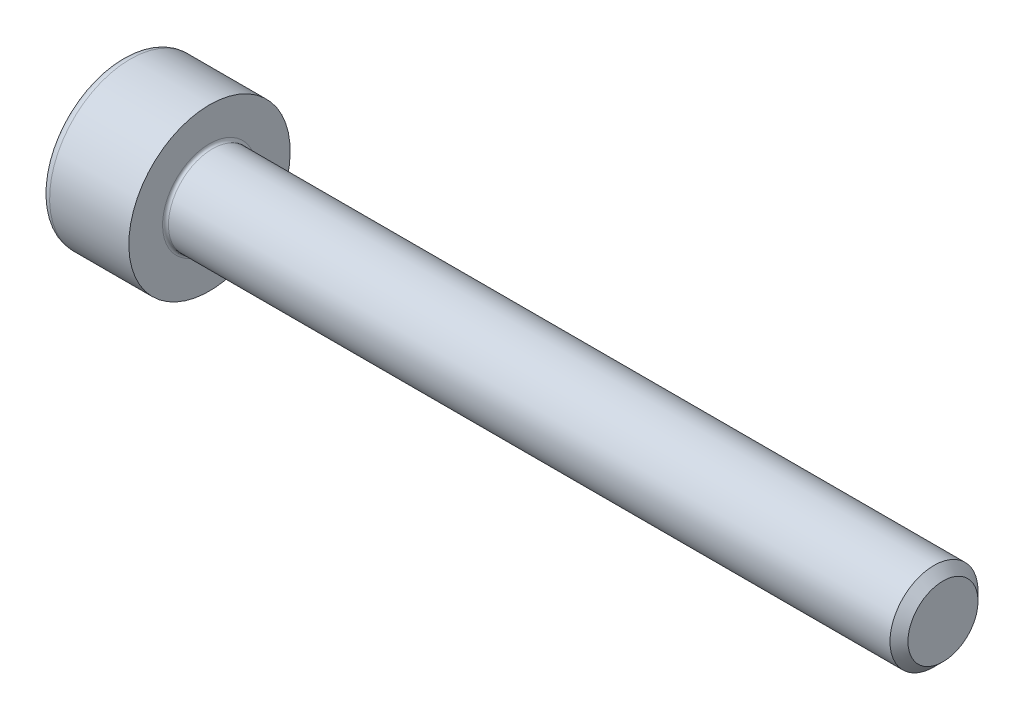
ISO-10303-21;
HEADER;
FILE_DESCRIPTION(('STEP AP214'),'2;1');
FILE_NAME('part.step','',(''),(''),'','','');
FILE_SCHEMA(('AUTOMOTIVE_DESIGN { 1 0 10303 214 1 1 1 1 }'));
ENDSEC;
DATA;
#1=APPLICATION_CONTEXT('core data for automotive mechanical design processes');
#2=APPLICATION_PROTOCOL_DEFINITION('international standard','automotive_design',2000,#1);
#3=PRODUCT_CONTEXT('',#1,'mechanical');
#4=PRODUCT('Part','Part','',(#3));
#5=PRODUCT_RELATED_PRODUCT_CATEGORY('part','',(#4));
#6=PRODUCT_DEFINITION_FORMATION('','',#4);
#7=PRODUCT_DEFINITION_CONTEXT('part definition',#1,'design');
#8=PRODUCT_DEFINITION('design','',#6,#7);
#9=PRODUCT_DEFINITION_SHAPE('','',#8);
#10=(LENGTH_UNIT() NAMED_UNIT(*) SI_UNIT(.MILLI.,.METRE.));
#11=(NAMED_UNIT(*) PLANE_ANGLE_UNIT() SI_UNIT($,.RADIAN.));
#12=(NAMED_UNIT(*) SI_UNIT($,.STERADIAN.) SOLID_ANGLE_UNIT());
#13=UNCERTAINTY_MEASURE_WITH_UNIT(LENGTH_MEASURE(1.E-05),#10,'distance_accuracy_value','');
#14=(GEOMETRIC_REPRESENTATION_CONTEXT(3) GLOBAL_UNCERTAINTY_ASSIGNED_CONTEXT((#13)) GLOBAL_UNIT_ASSIGNED_CONTEXT((#10,
#11,#12)) REPRESENTATION_CONTEXT('',''));
#15=CARTESIAN_POINT('',(0.,0.,0.));
#16=DIRECTION('',(0.,0.,1.));
#17=DIRECTION('',(1.,0.,0.));
#18=AXIS2_PLACEMENT_3D('',#15,#16,#17);
#19=CARTESIAN_POINT('',(-1.70499999995855,0.,0.));
#20=DIRECTION('',(-1.,0.,0.));
#21=DIRECTION('',(0.,0.,1.));
#22=AXIS2_PLACEMENT_3D('',#19,#20,#21);
#23=CONICAL_SURFACE('',#22,1.45203592694543,1.04719755118368);
#24=CARTESIAN_POINT('',(-0.866666666638594,0.,0.));
#25=VERTEX_POINT('',#24);
#26=VERTEX_LOOP('',#25);
#27=FACE_BOUND('',#26,.T.);
#28=CARTESIAN_POINT('',(-1.69999999999703,1.25,0.721687836487888));
#29=CARTESIAN_POINT('',(-1.68168471570057,1.25,0.658260217058919));
#30=CARTESIAN_POINT('',(-1.66502792318348,1.25,0.594285091321345));
#31=CARTESIAN_POINT('',(-1.63595399212002,1.25,0.46522715333814));
#32=CARTESIAN_POINT('',(-1.62354713770574,1.25,0.400142048729171));
#33=CARTESIAN_POINT('',(-1.60423497433511,1.25,0.270778406586236));
#34=CARTESIAN_POINT('',(-1.59720111724166,1.25,0.206519767731085));
#35=CARTESIAN_POINT('',(-1.58880573007492,1.25,0.0777002896402734));
#36=CARTESIAN_POINT('',(-1.58743724622727,1.25,0.0131399183071135));
#37=CARTESIAN_POINT('',(-1.59029143134034,1.25,-0.107484209658902));
#38=CARTESIAN_POINT('',(-1.59381330325391,1.25,-0.16356606692486));
#39=CARTESIAN_POINT('',(-1.604973312943,1.25,-0.275364426450217));
#40=CARTESIAN_POINT('',(-1.61261525922482,1.25,-0.331080542317558));
#41=CARTESIAN_POINT('',(-1.63171864583147,1.25,-0.443109217006952));
#42=CARTESIAN_POINT('',(-1.64326102638181,1.25,-0.499407604241041));
#43=CARTESIAN_POINT('',(-1.66945735052075,1.25,-0.611164931122247));
#44=CARTESIAN_POINT('',(-1.68410514296671,1.25,-0.666625301405443));
#45=CARTESIAN_POINT('',(-1.69999999999703,1.25,-0.72168783648789));
#46=B_SPLINE_CURVE_WITH_KNOTS('',3,(#28,#29,#30,#31,#32,#33,#34,#35,#36,#37,#38,#39,#40,#41,#42,
#43,#44,#45),.UNSPECIFIED.,.F.,.F.,(4,2,2,2,2,2,2,2,4),(0.,0.198135007224076,0.396746135644064,
0.590442253848449,0.783900555564741,0.952317364148294,1.12089012112463,1.29320101405853,
1.46517373344992),.UNSPECIFIED.);
#47=CARTESIAN_POINT('',(-1.69999999999703,1.25000000000037,0.721687836487247));
#48=VERTEX_POINT('',#47);
#49=CARTESIAN_POINT('',(-1.6999999999969,1.25,-0.721687836487461));
#50=VERTEX_POINT('',#49);
#51=EDGE_CURVE('E21',#48,#50,#46,.T.);
#52=ORIENTED_EDGE('',*,*,#51,.T.);
#53=CARTESIAN_POINT('',(-1.69999999999703,1.25000000000074,-0.721687836486606));
#54=CARTESIAN_POINT('',(-1.68168471570057,1.19507007027368,-0.753401646201091));
#55=CARTESIAN_POINT('',(-1.66502792318348,1.13966598617464,-0.785389209069878));
#56=CARTESIAN_POINT('',(-1.63595399212002,1.02789853332115,-0.84991817806148));
#57=CARTESIAN_POINT('',(-1.62354713770574,0.971533179321811,-0.882460730365965));
#58=CARTESIAN_POINT('',(-1.60423497433511,0.85950097889995,-0.947142551437432));
#59=CARTESIAN_POINT('',(-1.59720111724167,0.80385136523878,-0.979271870865007));
#60=CARTESIAN_POINT('',(-1.58880573007492,0.692290424709884,-1.04368160991041));
#61=CARTESIAN_POINT('',(-1.58743724622727,0.636379503057611,-1.07596179557699));
#62=CARTESIAN_POINT('',(-1.59029143134034,0.531915943929697,-1.13627385956));
#63=CARTESIAN_POINT('',(-1.59381330325391,0.483347630845964,-1.16431478819298));
#64=CARTESIAN_POINT('',(-1.604973312943,0.386527411395579,-1.22021396795566));
#65=CARTESIAN_POINT('',(-1.61261525922482,0.338275839654265,-1.24807202588933));
#66=CARTESIAN_POINT('',(-1.63171864583147,0.241256161420947,-1.30408636323403));
#67=CARTESIAN_POINT('',(-1.64326102638182,0.192500327884133,-1.33223555685107));
#68=CARTESIAN_POINT('',(-1.66945735052075,0.0957156437459675,-1.38811422029167));
#69=CARTESIAN_POINT('',(-1.68410514296671,0.0476855541774276,-1.41584440543327));
#70=CARTESIAN_POINT('',(-1.69999999999703,-7.42934727826491E-13,-1.44337567297449));
#71=B_SPLINE_CURVE_WITH_KNOTS('',3,(#53,#54,#55,#56,#57,#58,#59,#60,#61,#62,#63,#64,#65,#66,#67,
#68,#69,#70),.UNSPECIFIED.,.F.,.F.,(4,2,2,2,2,2,2,2,4),(0.,0.198135007224076,0.396746135644064,
0.590442253848448,0.783900555564741,0.952317364148293,1.12089012112463,1.29320101405852,
1.46517373344991),.UNSPECIFIED.);
#72=CARTESIAN_POINT('',(-1.69999999999703,0.,-1.4433756729745));
#73=VERTEX_POINT('',#72);
#74=EDGE_CURVE('E81',#50,#73,#71,.T.);
#75=ORIENTED_EDGE('',*,*,#74,.T.);
#76=CARTESIAN_POINT('',(-1.69999999999703,7.37871499272077E-13,-1.4433756729745));
#77=CARTESIAN_POINT('',(-1.68168471570057,-0.0549299297263211,-1.41166186326001));
#78=CARTESIAN_POINT('',(-1.66502792318348,-0.110334013825364,-1.37967430039122));
#79=CARTESIAN_POINT('',(-1.63595399212002,-0.222101466678857,-1.31514533139962));
#80=CARTESIAN_POINT('',(-1.62354713770574,-0.278466820678191,-1.28260277909514));
#81=CARTESIAN_POINT('',(-1.60423497433511,-0.390499021100053,-1.21792095802367));
#82=CARTESIAN_POINT('',(-1.59720111724167,-0.446148634761223,-1.18579163859609));
#83=CARTESIAN_POINT('',(-1.58880573007492,-0.55770957529012,-1.12138189955069));
#84=CARTESIAN_POINT('',(-1.58743724622727,-0.613620496942393,-1.08910171388411));
#85=CARTESIAN_POINT('',(-1.59029143134035,-0.718084056070307,-1.0287896499011));
#86=CARTESIAN_POINT('',(-1.59381330325391,-0.766652369154039,-1.00074872126812));
#87=CARTESIAN_POINT('',(-1.604973312943,-0.863472588604424,-0.944849541505444));
#88=CARTESIAN_POINT('',(-1.61261525922483,-0.911724160345738,-0.916991483571773));
#89=CARTESIAN_POINT('',(-1.63171864583147,-1.00874383857905,-0.860977146227077));
#90=CARTESIAN_POINT('',(-1.64326102638182,-1.05749967211587,-0.832827952610033));
#91=CARTESIAN_POINT('',(-1.66945735052075,-1.15428435625403,-0.776949289169431));
#92=CARTESIAN_POINT('',(-1.68410514296671,-1.20231444582257,-0.749219104027832));
#93=CARTESIAN_POINT('',(-1.69999999999703,-1.25000000000074,-0.721687836486609));
#94=B_SPLINE_CURVE_WITH_KNOTS('',3,(#76,#77,#78,#79,#80,#81,#82,#83,#84,#85,#86,#87,#88,#89,#90,
#91,#92,#93),.UNSPECIFIED.,.F.,.F.,(4,2,2,2,2,2,2,2,4),(0.,0.198135007224076,0.396746135644066,
0.59044225384845,0.783900555564743,0.952317364148295,1.12089012112463,1.29320101405852,
1.46517373344991),.UNSPECIFIED.);
#95=CARTESIAN_POINT('',(-1.69999999999703,-1.25000000000037,-0.72168783648725));
#96=VERTEX_POINT('',#95);
#97=EDGE_CURVE('E106',#73,#96,#94,.T.);
#98=ORIENTED_EDGE('',*,*,#97,.T.);
#99=CARTESIAN_POINT('',(-1.69999999999703,-1.25,-0.72168783648789));
#100=CARTESIAN_POINT('',(-1.68168471570057,-1.25,-0.658260217058921));
#101=CARTESIAN_POINT('',(-1.66502792318348,-1.25,-0.594285091321346));
#102=CARTESIAN_POINT('',(-1.63595399212002,-1.25,-0.465227153338142));
#103=CARTESIAN_POINT('',(-1.62354713770574,-1.25,-0.400142048729173));
#104=CARTESIAN_POINT('',(-1.60423497433511,-1.25,-0.270778406586237));
#105=CARTESIAN_POINT('',(-1.59720111724167,-1.25,-0.206519767731087));
#106=CARTESIAN_POINT('',(-1.58880573007492,-1.25,-0.0777002896402751));
#107=CARTESIAN_POINT('',(-1.58743724622727,-1.25,-0.0131399183071152));
#108=CARTESIAN_POINT('',(-1.59029143134034,-1.25,0.1074842096589));
#109=CARTESIAN_POINT('',(-1.59381330325391,-1.25,0.163566066924858));
#110=CARTESIAN_POINT('',(-1.604973312943,-1.25,0.275364426450216));
#111=CARTESIAN_POINT('',(-1.61261525922482,-1.25,0.331080542317556));
#112=CARTESIAN_POINT('',(-1.63171864583147,-1.25,0.44310921700695));
#113=CARTESIAN_POINT('',(-1.64326102638181,-1.25,0.499407604241038));
#114=CARTESIAN_POINT('',(-1.66945735052075,-1.25,0.611164931122244));
#115=CARTESIAN_POINT('',(-1.68410514296671,-1.25,0.666625301405441));
#116=CARTESIAN_POINT('',(-1.69999999999703,-1.25,0.721687836487888));
#117=B_SPLINE_CURVE_WITH_KNOTS('',3,(#99,#100,#101,#102,#103,#104,#105,#106,#107,#108,#109,#110,
#111,#112,#113,#114,#115,#116),.UNSPECIFIED.,.F.,.F.,(4,2,2,2,2,2,2,2,4),(0.,0.198135007224076,
0.396746135644065,0.590442253848449,0.783900555564741,0.952317364148294,1.12089012112463,
1.29320101405853,1.46517373344992),.UNSPECIFIED.);
#118=CARTESIAN_POINT('',(-1.69999999999703,-1.25000000000037,0.721687836487246));
#119=VERTEX_POINT('',#118);
#120=EDGE_CURVE('E130',#96,#119,#117,.T.);
#121=ORIENTED_EDGE('',*,*,#120,.T.);
#122=CARTESIAN_POINT('',(-1.69999999999703,-1.25000000000074,0.721687836486605));
#123=CARTESIAN_POINT('',(-1.68168471570057,-1.19507007027368,0.75340164620109));
#124=CARTESIAN_POINT('',(-1.66502792318348,-1.13966598617464,0.785389209069877));
#125=CARTESIAN_POINT('',(-1.63595399212002,-1.02789853332115,0.849918178061479));
#126=CARTESIAN_POINT('',(-1.62354713770574,-0.971533179321813,0.882460730365964));
#127=CARTESIAN_POINT('',(-1.60423497433511,-0.859500978899952,0.947142551437431));
#128=CARTESIAN_POINT('',(-1.59720111724167,-0.803851365238782,0.979271870865006));
#129=CARTESIAN_POINT('',(-1.58880573007492,-0.692290424709886,1.04368160991041));
#130=CARTESIAN_POINT('',(-1.58743724622727,-0.636379503057612,1.07596179557699));
#131=CARTESIAN_POINT('',(-1.59029143134034,-0.531915943929698,1.13627385956));
#132=CARTESIAN_POINT('',(-1.59381330325391,-0.483347630845966,1.16431478819298));
#133=CARTESIAN_POINT('',(-1.604973312943,-0.38652741139558,1.22021396795566));
#134=CARTESIAN_POINT('',(-1.61261525922482,-0.338275839654266,1.24807202588933));
#135=CARTESIAN_POINT('',(-1.63171864583147,-0.241256161420948,1.30408636323402));
#136=CARTESIAN_POINT('',(-1.64326102638182,-0.192500327884134,1.33223555685107));
#137=CARTESIAN_POINT('',(-1.66945735052075,-0.095715643745968,1.38811422029167));
#138=CARTESIAN_POINT('',(-1.68410514296671,-0.0476855541774282,1.41584440543327));
#139=CARTESIAN_POINT('',(-1.69999999999703,7.42500278451778E-13,1.44337567297449));
#140=B_SPLINE_CURVE_WITH_KNOTS('',3,(#122,#123,#124,#125,#126,#127,#128,#129,#130,#131,#132,
#133,#134,#135,#136,#137,#138,#139),.UNSPECIFIED.,.F.,.F.,(4,2,2,2,2,2,2,2,4),(0.,
0.198135007224075,0.396746135644065,0.590442253848449,0.783900555564742,0.952317364148295,
1.12089012112463,1.29320101405853,1.46517373344992),.UNSPECIFIED.);
#141=CARTESIAN_POINT('',(-1.69999999999703,0.,1.4433756729745));
#142=VERTEX_POINT('',#141);
#143=EDGE_CURVE('E138',#119,#142,#140,.T.);
#144=ORIENTED_EDGE('',*,*,#143,.T.);
#145=CARTESIAN_POINT('',(-1.69999999999703,-7.3880623636775E-13,1.4433756729745));
#146=CARTESIAN_POINT('',(-1.68168471570057,0.0549299297263202,1.41166186326001));
#147=CARTESIAN_POINT('',(-1.66502792318348,0.110334013825363,1.37967430039122));
#148=CARTESIAN_POINT('',(-1.63595399212002,0.222101466678855,1.31514533139962));
#149=CARTESIAN_POINT('',(-1.62354713770574,0.27846682067819,1.28260277909514));
#150=CARTESIAN_POINT('',(-1.60423497433511,0.390499021100052,1.21792095802367));
#151=CARTESIAN_POINT('',(-1.59720111724167,0.446148634761222,1.18579163859609));
#152=CARTESIAN_POINT('',(-1.58880573007492,0.557709575290118,1.12138189955069));
#153=CARTESIAN_POINT('',(-1.58743724622727,0.613620496942391,1.08910171388411));
#154=CARTESIAN_POINT('',(-1.59029143134034,0.718084056070306,1.0287896499011));
#155=CARTESIAN_POINT('',(-1.59381330325391,0.766652369154038,1.00074872126812));
#156=CARTESIAN_POINT('',(-1.604973312943,0.863472588604423,0.944849541505442));
#157=CARTESIAN_POINT('',(-1.61261525922482,0.911724160345737,0.916991483571772));
#158=CARTESIAN_POINT('',(-1.63171864583147,1.00874383857905,0.860977146227076));
#159=CARTESIAN_POINT('',(-1.64326102638182,1.05749967211587,0.832827952610031));
#160=CARTESIAN_POINT('',(-1.66945735052075,1.15428435625403,0.776949289169429));
#161=CARTESIAN_POINT('',(-1.68410514296671,1.20231444582257,0.74921910402783));
#162=CARTESIAN_POINT('',(-1.69999999999703,1.25000000000074,0.721687836486607));
#163=B_SPLINE_CURVE_WITH_KNOTS('',3,(#145,#146,#147,#148,#149,#150,#151,#152,#153,#154,#155,
#156,#157,#158,#159,#160,#161,#162),.UNSPECIFIED.,.F.,.F.,(4,2,2,2,2,2,2,2,4),(0.,
0.198135007224076,0.396746135644066,0.59044225384845,0.783900555564744,0.952317364148296,
1.12089012112463,1.29320101405853,1.46517373344991),.UNSPECIFIED.);
#164=EDGE_CURVE('E83',#142,#48,#163,.T.);
#165=ORIENTED_EDGE('',*,*,#164,.T.);
#166=EDGE_LOOP('',(#52,#75,#98,#121,#144,#165));
#167=FACE_BOUND('',#166,.T.);
#168=ADVANCED_FACE('F17',(#27,#167),#23,.F.);
#169=CARTESIAN_POINT('',(-2.99999999999999,1.25,0.721687836487031));
#170=DIRECTION('',(0.,1.,0.));
#171=DIRECTION('',(0.,0.,1.));
#172=AXIS2_PLACEMENT_3D('',#169,#170,#171);
#173=PLANE('',#172);
#174=DIRECTION('',(1.,0.,0.));
#175=VECTOR('',#174,1.);
#176=CARTESIAN_POINT('',(-2.99999999999999,1.25,0.721687836487034));
#177=LINE('',#176,#175);
#178=CARTESIAN_POINT('',(-2.99999999999999,1.25,0.721687836487032));
#179=VERTEX_POINT('',#178);
#180=EDGE_CURVE('E85',#48,#179,#177,.F.);
#181=ORIENTED_EDGE('',*,*,#180,.T.);
#182=DIRECTION('',(0.,0.,1.));
#183=VECTOR('',#182,1.);
#184=CARTESIAN_POINT('',(-2.99999999999999,1.25,0.));
#185=LINE('',#184,#183);
#186=CARTESIAN_POINT('',(-2.99999999999999,1.25,-0.721687836487033));
#187=VERTEX_POINT('',#186);
#188=EDGE_CURVE('E90',#187,#179,#185,.T.);
#189=ORIENTED_EDGE('',*,*,#188,.F.);
#190=DIRECTION('',(1.,0.,0.));
#191=VECTOR('',#190,1.);
#192=CARTESIAN_POINT('',(-2.99999999999999,1.25,-0.721687836487033));
#193=LINE('',#192,#191);
#194=EDGE_CURVE('E88',#187,#50,#193,.T.);
#195=ORIENTED_EDGE('',*,*,#194,.T.);
#196=ORIENTED_EDGE('',*,*,#51,.F.);
#197=EDGE_LOOP('',(#181,#189,#195,#196));
#198=FACE_BOUND('',#197,.T.);
#199=ADVANCED_FACE('F77',(#198),#173,.F.);
#200=CARTESIAN_POINT('',(-2.99999999999999,0.,1.44337567297407));
#201=DIRECTION('',(0.,0.500000000000001,0.866025403784438));
#202=DIRECTION('',(0.,-0.866025403784438,0.500000000000001));
#203=AXIS2_PLACEMENT_3D('',#200,#201,#202);
#204=PLANE('',#203);
#205=DIRECTION('',(1.,0.,0.));
#206=VECTOR('',#205,1.);
#207=CARTESIAN_POINT('',(-2.99999999999999,0.,1.44337567297407));
#208=LINE('',#207,#206);
#209=CARTESIAN_POINT('',(-2.99999999999999,0.,1.44337567297407));
#210=VERTEX_POINT('',#209);
#211=EDGE_CURVE('E142',#142,#210,#208,.F.);
#212=ORIENTED_EDGE('',*,*,#211,.T.);
#213=DIRECTION('',(0.,-0.866025403784437,0.500000000000004));
#214=VECTOR('',#213,1.);
#215=CARTESIAN_POINT('',(-2.99999999999999,1.25,0.721687836487031));
#216=LINE('',#215,#214);
#217=EDGE_CURVE('E96',#179,#210,#216,.T.);
#218=ORIENTED_EDGE('',*,*,#217,.F.);
#219=ORIENTED_EDGE('',*,*,#180,.F.);
#220=ORIENTED_EDGE('',*,*,#164,.F.);
#221=EDGE_LOOP('',(#212,#218,#219,#220));
#222=FACE_BOUND('',#221,.T.);
#223=ADVANCED_FACE('F146',(#222),#204,.F.);
#224=CARTESIAN_POINT('',(-2.99999999999999,-1.25,0.721687836487033));
#225=DIRECTION('',(0.,-0.5,0.866025403784439));
#226=DIRECTION('',(0.,-0.866025403784439,-0.5));
#227=AXIS2_PLACEMENT_3D('',#224,#225,#226);
#228=PLANE('',#227);
#229=DIRECTION('',(1.,0.,0.));
#230=VECTOR('',#229,1.);
#231=CARTESIAN_POINT('',(-2.99999999999999,-1.25,0.721687836487032));
#232=LINE('',#231,#230);
#233=CARTESIAN_POINT('',(-2.99999999999999,-1.25,0.721687836487032));
#234=VERTEX_POINT('',#233);
#235=EDGE_CURVE('E137',#119,#234,#232,.F.);
#236=ORIENTED_EDGE('',*,*,#235,.T.);
#237=DIRECTION('',(0.,-0.866025403784437,-0.500000000000003));
#238=VECTOR('',#237,1.);
#239=CARTESIAN_POINT('',(-2.99999999999999,0.,1.44337567297407));
#240=LINE('',#239,#238);
#241=EDGE_CURVE('E265',#210,#234,#240,.T.);
#242=ORIENTED_EDGE('',*,*,#241,.F.);
#243=ORIENTED_EDGE('',*,*,#211,.F.);
#244=ORIENTED_EDGE('',*,*,#143,.F.);
#245=EDGE_LOOP('',(#236,#242,#243,#244));
#246=FACE_BOUND('',#245,.T.);
#247=ADVANCED_FACE('F126',(#246),#228,.F.);
#248=CARTESIAN_POINT('',(-2.99999999999999,-1.25,-0.721687836487032));
#249=DIRECTION('',(0.,-1.,0.));
#250=DIRECTION('',(1.,0.,0.));
#251=AXIS2_PLACEMENT_3D('',#248,#249,#250);
#252=PLANE('',#251);
#253=DIRECTION('',(1.,0.,0.));
#254=VECTOR('',#253,1.);
#255=CARTESIAN_POINT('',(-2.99999999999999,-1.25,-0.721687836487037));
#256=LINE('',#255,#254);
#257=CARTESIAN_POINT('',(-2.99999999999999,-1.25,-0.721687836487034));
#258=VERTEX_POINT('',#257);
#259=EDGE_CURVE('E136',#96,#258,#256,.F.);
#260=ORIENTED_EDGE('',*,*,#259,.T.);
#261=DIRECTION('',(0.,0.,1.));
#262=VECTOR('',#261,1.);
#263=CARTESIAN_POINT('',(-2.99999999999999,-1.25,0.));
#264=LINE('',#263,#262);
#265=EDGE_CURVE('E260',#234,#258,#264,.F.);
#266=ORIENTED_EDGE('',*,*,#265,.F.);
#267=ORIENTED_EDGE('',*,*,#235,.F.);
#268=ORIENTED_EDGE('',*,*,#120,.F.);
#269=EDGE_LOOP('',(#260,#266,#267,#268));
#270=FACE_BOUND('',#269,.T.);
#271=ADVANCED_FACE('F122',(#270),#252,.F.);
#272=CARTESIAN_POINT('',(-2.99999999999999,0.,-1.44337567297407));
#273=DIRECTION('',(0.,-0.5,-0.866025403784439));
#274=DIRECTION('',(0.,0.866025403784439,-0.5));
#275=AXIS2_PLACEMENT_3D('',#272,#273,#274);
#276=PLANE('',#275);
#277=DIRECTION('',(1.,0.,0.));
#278=VECTOR('',#277,1.);
#279=CARTESIAN_POINT('',(-2.99999999999999,0.,-1.44337567297407));
#280=LINE('',#279,#278);
#281=CARTESIAN_POINT('',(-2.99999999999999,0.,-1.44337567297407));
#282=VERTEX_POINT('',#281);
#283=EDGE_CURVE('E39',#73,#282,#280,.F.);
#284=ORIENTED_EDGE('',*,*,#283,.T.);
#285=DIRECTION('',(0.,0.866025403784437,-0.500000000000003));
#286=VECTOR('',#285,1.);
#287=CARTESIAN_POINT('',(-2.99999999999999,-1.25,-0.721687836487032));
#288=LINE('',#287,#286);
#289=EDGE_CURVE('E255',#258,#282,#288,.T.);
#290=ORIENTED_EDGE('',*,*,#289,.F.);
#291=ORIENTED_EDGE('',*,*,#259,.F.);
#292=ORIENTED_EDGE('',*,*,#97,.F.);
#293=EDGE_LOOP('',(#284,#290,#291,#292));
#294=FACE_BOUND('',#293,.T.);
#295=ADVANCED_FACE('F116',(#294),#276,.F.);
#296=CARTESIAN_POINT('',(-2.99999999999999,1.25,-0.721687836487033));
#297=DIRECTION('',(0.,0.5,-0.866025403784439));
#298=DIRECTION('',(0.,0.866025403784439,0.5));
#299=AXIS2_PLACEMENT_3D('',#296,#297,#298);
#300=PLANE('',#299);
#301=ORIENTED_EDGE('',*,*,#194,.F.);
#302=DIRECTION('',(0.,0.866025403784437,0.500000000000002));
#303=VECTOR('',#302,1.);
#304=CARTESIAN_POINT('',(-2.99999999999999,0.,-1.44337567297407));
#305=LINE('',#304,#303);
#306=EDGE_CURVE('E253',#282,#187,#305,.T.);
#307=ORIENTED_EDGE('',*,*,#306,.F.);
#308=ORIENTED_EDGE('',*,*,#283,.F.);
#309=ORIENTED_EDGE('',*,*,#74,.F.);
#310=EDGE_LOOP('',(#301,#307,#308,#309));
#311=FACE_BOUND('',#310,.T.);
#312=ADVANCED_FACE('F94',(#311),#300,.F.);
#313=CARTESIAN_POINT('',(-2.99999999999999,2.09668783648703,0.));
#314=DIRECTION('',(-1.,0.,0.));
#315=DIRECTION('',(0.,-1.,0.));
#316=AXIS2_PLACEMENT_3D('',#313,#314,#315);
#317=PLANE('',#316);
#318=ORIENTED_EDGE('',*,*,#289,.T.);
#319=ORIENTED_EDGE('',*,*,#306,.T.);
#320=ORIENTED_EDGE('',*,*,#188,.T.);
#321=ORIENTED_EDGE('',*,*,#217,.T.);
#322=ORIENTED_EDGE('',*,*,#241,.T.);
#323=ORIENTED_EDGE('',*,*,#265,.T.);
#324=EDGE_LOOP('',(#318,#319,#320,#321,#322,#323));
#325=FACE_BOUND('',#324,.T.);
#326=CARTESIAN_POINT('',(-2.99999999999999,0.,0.));
#327=DIRECTION('',(1.,0.,0.));
#328=DIRECTION('',(0.,1.,0.));
#329=AXIS2_PLACEMENT_3D('',#326,#327,#328);
#330=CIRCLE('',#329,2.45);
#331=CARTESIAN_POINT('',(-2.99999999999999,2.45,0.));
#332=VERTEX_POINT('',#331);
#333=EDGE_CURVE('E216',#332,#332,#330,.T.);
#334=ORIENTED_EDGE('',*,*,#333,.F.);
#335=EDGE_LOOP('',(#334));
#336=FACE_BOUND('',#335,.T.);
#337=ADVANCED_FACE('F115',(#325,#336),#317,.T.);
#338=CARTESIAN_POINT('',(-2.69999999999999,0.,0.));
#339=DIRECTION('',(1.,0.,0.));
#340=DIRECTION('',(0.,0.,-1.));
#341=AXIS2_PLACEMENT_3D('',#338,#339,#340);
#342=TOROIDAL_SURFACE('',#341,2.45,0.3);
#343=CARTESIAN_POINT('',(-2.69999999999999,0.,0.));
#344=DIRECTION('',(1.,0.,0.));
#345=DIRECTION('',(0.,1.,0.));
#346=AXIS2_PLACEMENT_3D('',#343,#344,#345);
#347=CIRCLE('',#346,2.75);
#348=CARTESIAN_POINT('',(-2.69999999999999,2.75,0.));
#349=VERTEX_POINT('',#348);
#350=EDGE_CURVE('E280',#349,#349,#347,.T.);
#351=ORIENTED_EDGE('',*,*,#350,.F.);
#352=EDGE_LOOP('',(#351));
#353=FACE_BOUND('',#352,.T.);
#354=ORIENTED_EDGE('',*,*,#333,.T.);
#355=EDGE_LOOP('',(#354));
#356=FACE_BOUND('',#355,.T.);
#357=ADVANCED_FACE('F200',(#353,#356),#342,.T.);
#358=CARTESIAN_POINT('',(-1.49999999999999,0.,0.));
#359=DIRECTION('',(1.,0.,0.));
#360=DIRECTION('',(0.,1.,0.));
#361=AXIS2_PLACEMENT_3D('',#358,#359,#360);
#362=CYLINDRICAL_SURFACE('',#361,2.75);
#363=ORIENTED_EDGE('',*,*,#350,.T.);
#364=EDGE_LOOP('',(#363));
#365=FACE_BOUND('',#364,.T.);
#366=CARTESIAN_POINT('',(0.,0.,0.));
#367=DIRECTION('',(1.,0.,0.));
#368=DIRECTION('',(0.,1.,0.));
#369=AXIS2_PLACEMENT_3D('',#366,#367,#368);
#370=CIRCLE('',#369,2.75);
#371=CARTESIAN_POINT('',(0.,2.75,0.));
#372=VERTEX_POINT('',#371);
#373=EDGE_CURVE('E104',#372,#372,#370,.T.);
#374=ORIENTED_EDGE('',*,*,#373,.F.);
#375=EDGE_LOOP('',(#374));
#376=FACE_BOUND('',#375,.T.);
#377=ADVANCED_FACE('F197',(#365,#376),#362,.T.);
#378=CARTESIAN_POINT('',(25.,0.75,0.));
#379=DIRECTION('',(1.,0.,0.));
#380=DIRECTION('',(0.,1.,0.));
#381=AXIS2_PLACEMENT_3D('',#378,#379,#380);
#382=PLANE('',#381);
#383=CARTESIAN_POINT('',(24.9999999999773,0.,0.));
#384=DIRECTION('',(-1.,0.,0.));
#385=DIRECTION('',(0.,0.,1.));
#386=AXIS2_PLACEMENT_3D('',#383,#384,#385);
#387=CIRCLE('',#386,1.19327500004829);
#388=CARTESIAN_POINT('',(24.9999999999773,0.,1.19327500004829));
#389=VERTEX_POINT('',#388);
#390=EDGE_CURVE('E275',#389,#389,#387,.T.);
#391=ORIENTED_EDGE('',*,*,#390,.F.);
#392=EDGE_LOOP('',(#391));
#393=FACE_BOUND('',#392,.T.);
#394=ADVANCED_FACE('F194',(#393),#382,.T.);
#395=CARTESIAN_POINT('',(0.,2.125,0.));
#396=DIRECTION('',(1.,0.,0.));
#397=DIRECTION('',(0.,1.,0.));
#398=AXIS2_PLACEMENT_3D('',#395,#396,#397);
#399=PLANE('',#398);
#400=CARTESIAN_POINT('',(0.,0.,0.));
#401=DIRECTION('',(1.,0.,0.));
#402=DIRECTION('',(0.,1.,0.));
#403=AXIS2_PLACEMENT_3D('',#400,#401,#402);
#404=CIRCLE('',#403,1.6);
#405=CARTESIAN_POINT('',(0.,1.6,0.));
#406=VERTEX_POINT('',#405);
#407=EDGE_CURVE('E181',#406,#406,#404,.F.);
#408=ORIENTED_EDGE('',*,*,#407,.T.);
#409=EDGE_LOOP('',(#408));
#410=FACE_BOUND('',#409,.T.);
#411=ORIENTED_EDGE('',*,*,#373,.T.);
#412=EDGE_LOOP('',(#411));
#413=FACE_BOUND('',#412,.T.);
#414=ADVANCED_FACE('F185',(#410,#413),#399,.T.);
#415=CARTESIAN_POINT('',(24.6932750001179,0.,0.));
#416=DIRECTION('',(-1.,0.,0.));
#417=DIRECTION('',(0.,0.,1.));
#418=AXIS2_PLACEMENT_3D('',#415,#416,#417);
#419=CONICAL_SURFACE('',#418,1.49999999990769,0.785398163397448);
#420=ORIENTED_EDGE('',*,*,#390,.T.);
#421=EDGE_LOOP('',(#420));
#422=FACE_BOUND('',#421,.T.);
#423=CARTESIAN_POINT('',(24.693275,0.,0.));
#424=DIRECTION('',(1.,0.,0.));
#425=DIRECTION('',(0.,1.,0.));
#426=AXIS2_PLACEMENT_3D('',#423,#424,#425);
#427=CIRCLE('',#426,1.5);
#428=CARTESIAN_POINT('',(24.693275,1.5,0.));
#429=VERTEX_POINT('',#428);
#430=EDGE_CURVE('E30',#429,#429,#427,.F.);
#431=ORIENTED_EDGE('',*,*,#430,.F.);
#432=EDGE_LOOP('',(#431));
#433=FACE_BOUND('',#432,.T.);
#434=ADVANCED_FACE('F163',(#422,#433),#419,.T.);
#435=CARTESIAN_POINT('',(0.100000000000002,0.,0.));
#436=DIRECTION('',(1.,0.,0.));
#437=DIRECTION('',(0.,0.,-1.));
#438=AXIS2_PLACEMENT_3D('',#435,#436,#437);
#439=TOROIDAL_SURFACE('',#438,1.6,0.1);
#440=CARTESIAN_POINT('',(0.100000000000003,0.,0.));
#441=DIRECTION('',(1.,0.,0.));
#442=DIRECTION('',(0.,1.,0.));
#443=AXIS2_PLACEMENT_3D('',#440,#441,#442);
#444=CIRCLE('',#443,1.5);
#445=CARTESIAN_POINT('',(0.100000000000003,1.5,0.));
#446=VERTEX_POINT('',#445);
#447=EDGE_CURVE('E11',#446,#446,#444,.T.);
#448=ORIENTED_EDGE('',*,*,#447,.F.);
#449=EDGE_LOOP('',(#448));
#450=FACE_BOUND('',#449,.T.);
#451=ORIENTED_EDGE('',*,*,#407,.F.);
#452=EDGE_LOOP('',(#451));
#453=FACE_BOUND('',#452,.T.);
#454=ADVANCED_FACE('F157',(#450,#453),#439,.F.);
#455=CARTESIAN_POINT('',(16.,0.,0.));
#456=DIRECTION('',(1.,0.,0.));
#457=DIRECTION('',(0.,1.,0.));
#458=AXIS2_PLACEMENT_3D('',#455,#456,#457);
#459=CYLINDRICAL_SURFACE('',#458,1.5);
#460=ORIENTED_EDGE('',*,*,#447,.T.);
#461=EDGE_LOOP('',(#460));
#462=FACE_BOUND('',#461,.T.);
#463=ORIENTED_EDGE('',*,*,#430,.T.);
#464=EDGE_LOOP('',(#463));
#465=FACE_BOUND('',#464,.T.);
#466=ADVANCED_FACE('F155',(#462,#465),#459,.T.);
#467=CLOSED_SHELL('',(#168,#199,#223,#247,#271,#295,#312,#337,#357,#377,#394,#414,#434,#454,#466));
#468=MANIFOLD_SOLID_BREP('B1',#467);
#469=ADVANCED_BREP_SHAPE_REPRESENTATION('',(#18,#468),#14);
#470=SHAPE_DEFINITION_REPRESENTATION(#9,#469);
ENDSEC;
END-ISO-10303-21;
